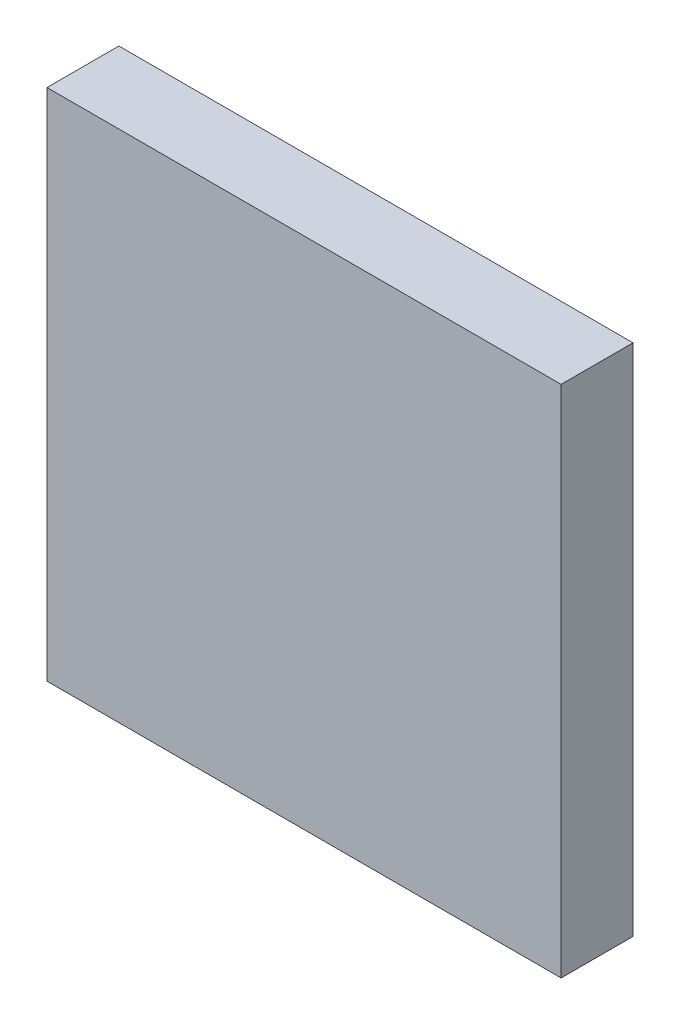
ISO-10303-21;
HEADER;
FILE_DESCRIPTION(('STEP AP214'),'2;1');
FILE_NAME('part.step','',(''),(''),'','','');
FILE_SCHEMA(('AUTOMOTIVE_DESIGN { 1 0 10303 214 1 1 1 1 }'));
ENDSEC;
DATA;
#1=APPLICATION_CONTEXT('core data for automotive mechanical design processes');
#2=APPLICATION_PROTOCOL_DEFINITION('international standard','automotive_design',2000,#1);
#3=PRODUCT_CONTEXT('',#1,'mechanical');
#4=PRODUCT('Part','Part','',(#3));
#5=PRODUCT_RELATED_PRODUCT_CATEGORY('part','',(#4));
#6=PRODUCT_DEFINITION_FORMATION('','',#4);
#7=PRODUCT_DEFINITION_CONTEXT('part definition',#1,'design');
#8=PRODUCT_DEFINITION('design','',#6,#7);
#9=PRODUCT_DEFINITION_SHAPE('','',#8);
#10=(LENGTH_UNIT() NAMED_UNIT(*) SI_UNIT(.MILLI.,.METRE.));
#11=(NAMED_UNIT(*) PLANE_ANGLE_UNIT() SI_UNIT($,.RADIAN.));
#12=(NAMED_UNIT(*) SI_UNIT($,.STERADIAN.) SOLID_ANGLE_UNIT());
#13=UNCERTAINTY_MEASURE_WITH_UNIT(LENGTH_MEASURE(1.E-05),#10,'distance_accuracy_value','');
#14=(GEOMETRIC_REPRESENTATION_CONTEXT(3) GLOBAL_UNCERTAINTY_ASSIGNED_CONTEXT((#13)) GLOBAL_UNIT_ASSIGNED_CONTEXT((#10,
#11,#12)) REPRESENTATION_CONTEXT('',''));
#15=CARTESIAN_POINT('',(0.,0.,0.));
#16=DIRECTION('',(0.,0.,1.));
#17=DIRECTION('',(1.,0.,0.));
#18=AXIS2_PLACEMENT_3D('',#15,#16,#17);
#19=CARTESIAN_POINT('',(1.270000005443E-06,1.270000005319E-06,1.00000054));
#20=DIRECTION('',(0.,0.,1.));
#21=DIRECTION('',(1.,0.,0.));
#22=AXIS2_PLACEMENT_3D('',#19,#20,#21);
#23=PLANE('',#22);
#24=DIRECTION('',(0.,1.,0.));
#25=VECTOR('',#24,1.);
#26=CARTESIAN_POINT('',(-3.5749992,3.57500174,1.00000054));
#27=LINE('',#26,#25);
#28=CARTESIAN_POINT('',(-3.5749992,3.57500174,1.00000054));
#29=VERTEX_POINT('',#28);
#30=CARTESIAN_POINT('',(-3.5749992,-3.5749992,1.00000054));
#31=VERTEX_POINT('',#30);
#32=EDGE_CURVE('E76',#29,#31,#27,.F.);
#33=ORIENTED_EDGE('',*,*,#32,.T.);
#34=DIRECTION('',(1.,0.,0.));
#35=VECTOR('',#34,1.);
#36=CARTESIAN_POINT('',(-3.5749992,-3.5749992,1.00000054));
#37=LINE('',#36,#35);
#38=CARTESIAN_POINT('',(3.57500174,-3.5749992,1.00000054));
#39=VERTEX_POINT('',#38);
#40=EDGE_CURVE('E58',#31,#39,#37,.T.);
#41=ORIENTED_EDGE('',*,*,#40,.T.);
#42=DIRECTION('',(0.,1.,0.));
#43=VECTOR('',#42,1.);
#44=CARTESIAN_POINT('',(3.57500174,-3.5749992,1.00000054));
#45=LINE('',#44,#43);
#46=CARTESIAN_POINT('',(3.57500174,3.57500174,1.00000054));
#47=VERTEX_POINT('',#46);
#48=EDGE_CURVE('E20',#39,#47,#45,.T.);
#49=ORIENTED_EDGE('',*,*,#48,.T.);
#50=DIRECTION('',(1.,0.,0.));
#51=VECTOR('',#50,1.);
#52=CARTESIAN_POINT('',(3.57500174,3.57500174,1.00000054));
#53=LINE('',#52,#51);
#54=EDGE_CURVE('E55',#47,#29,#53,.F.);
#55=ORIENTED_EDGE('',*,*,#54,.T.);
#56=EDGE_LOOP('',(#33,#41,#49,#55));
#57=FACE_BOUND('',#56,.T.);
#58=ADVANCED_FACE('F17',(#57),#23,.T.);
#59=CARTESIAN_POINT('',(3.57500174,-3.5749992,0.));
#60=DIRECTION('',(-1.,0.,0.));
#61=DIRECTION('',(0.,0.,1.));
#62=AXIS2_PLACEMENT_3D('',#59,#60,#61);
#63=PLANE('',#62);
#64=DIRECTION('',(0.,0.,-1.));
#65=VECTOR('',#64,1.);
#66=CARTESIAN_POINT('',(3.57500174,3.57500174,0.));
#67=LINE('',#66,#65);
#68=CARTESIAN_POINT('',(3.57500174,3.57500174,0.));
#69=VERTEX_POINT('',#68);
#70=EDGE_CURVE('E63',#69,#47,#67,.F.);
#71=ORIENTED_EDGE('',*,*,#70,.T.);
#72=ORIENTED_EDGE('',*,*,#48,.F.);
#73=DIRECTION('',(0.,0.,1.));
#74=VECTOR('',#73,1.);
#75=CARTESIAN_POINT('',(3.57500174,-3.5749992,0.));
#76=LINE('',#75,#74);
#77=CARTESIAN_POINT('',(3.57500174,-3.5749992,0.));
#78=VERTEX_POINT('',#77);
#79=EDGE_CURVE('E80',#39,#78,#76,.F.);
#80=ORIENTED_EDGE('',*,*,#79,.T.);
#81=DIRECTION('',(0.,1.,0.));
#82=VECTOR('',#81,1.);
#83=CARTESIAN_POINT('',(3.57500174,1.270000005319E-06,0.));
#84=LINE('',#83,#82);
#85=EDGE_CURVE('E73',#78,#69,#84,.T.);
#86=ORIENTED_EDGE('',*,*,#85,.T.);
#87=EDGE_LOOP('',(#71,#72,#80,#86));
#88=FACE_BOUND('',#87,.T.);
#89=ADVANCED_FACE('F72',(#88),#63,.F.);
#90=CARTESIAN_POINT('',(3.57500174,3.57500174,0.));
#91=DIRECTION('',(0.,-1.,0.));
#92=DIRECTION('',(0.,0.,-1.));
#93=AXIS2_PLACEMENT_3D('',#90,#91,#92);
#94=PLANE('',#93);
#95=DIRECTION('',(0.,0.,-1.));
#96=VECTOR('',#95,1.);
#97=CARTESIAN_POINT('',(-3.5749992,3.57500174,0.));
#98=LINE('',#97,#96);
#99=CARTESIAN_POINT('',(-3.5749992,3.57500174,0.));
#100=VERTEX_POINT('',#99);
#101=EDGE_CURVE('E69',#100,#29,#98,.F.);
#102=ORIENTED_EDGE('',*,*,#101,.T.);
#103=ORIENTED_EDGE('',*,*,#54,.F.);
#104=ORIENTED_EDGE('',*,*,#70,.F.);
#105=DIRECTION('',(1.,0.,0.));
#106=VECTOR('',#105,1.);
#107=CARTESIAN_POINT('',(1.270000005443E-06,3.57500174,0.));
#108=LINE('',#107,#106);
#109=EDGE_CURVE('E83',#69,#100,#108,.F.);
#110=ORIENTED_EDGE('',*,*,#109,.T.);
#111=EDGE_LOOP('',(#102,#103,#104,#110));
#112=FACE_BOUND('',#111,.T.);
#113=ADVANCED_FACE('F66',(#112),#94,.F.);
#114=CARTESIAN_POINT('',(-3.5749992,3.57500174,0.));
#115=DIRECTION('',(1.,0.,0.));
#116=DIRECTION('',(0.,0.,-1.));
#117=AXIS2_PLACEMENT_3D('',#114,#115,#116);
#118=PLANE('',#117);
#119=DIRECTION('',(0.,0.,1.));
#120=VECTOR('',#119,1.);
#121=CARTESIAN_POINT('',(-3.5749992,-3.5749992,0.));
#122=LINE('',#121,#120);
#123=CARTESIAN_POINT('',(-3.5749992,-3.5749992,0.));
#124=VERTEX_POINT('',#123);
#125=EDGE_CURVE('E34',#124,#31,#122,.T.);
#126=ORIENTED_EDGE('',*,*,#125,.T.);
#127=ORIENTED_EDGE('',*,*,#32,.F.);
#128=ORIENTED_EDGE('',*,*,#101,.F.);
#129=DIRECTION('',(0.,1.,0.));
#130=VECTOR('',#129,1.);
#131=CARTESIAN_POINT('',(-3.5749992,1.270000005319E-06,0.));
#132=LINE('',#131,#130);
#133=EDGE_CURVE('E26',#100,#124,#132,.F.);
#134=ORIENTED_EDGE('',*,*,#133,.T.);
#135=EDGE_LOOP('',(#126,#127,#128,#134));
#136=FACE_BOUND('',#135,.T.);
#137=ADVANCED_FACE('F88',(#136),#118,.F.);
#138=CARTESIAN_POINT('',(-3.5749992,-3.5749992,0.));
#139=DIRECTION('',(0.,1.,0.));
#140=DIRECTION('',(0.,0.,1.));
#141=AXIS2_PLACEMENT_3D('',#138,#139,#140);
#142=PLANE('',#141);
#143=ORIENTED_EDGE('',*,*,#79,.F.);
#144=ORIENTED_EDGE('',*,*,#40,.F.);
#145=ORIENTED_EDGE('',*,*,#125,.F.);
#146=DIRECTION('',(1.,0.,0.));
#147=VECTOR('',#146,1.);
#148=CARTESIAN_POINT('',(1.270000005443E-06,-3.5749992,0.));
#149=LINE('',#148,#147);
#150=EDGE_CURVE('E11',#124,#78,#149,.T.);
#151=ORIENTED_EDGE('',*,*,#150,.T.);
#152=EDGE_LOOP('',(#143,#144,#145,#151));
#153=FACE_BOUND('',#152,.T.);
#154=ADVANCED_FACE('F91',(#153),#142,.F.);
#155=CARTESIAN_POINT('',(1.270000005443E-06,1.270000005319E-06,0.));
#156=DIRECTION('',(0.,0.,1.));
#157=DIRECTION('',(1.,0.,0.));
#158=AXIS2_PLACEMENT_3D('',#155,#156,#157);
#159=PLANE('',#158);
#160=ORIENTED_EDGE('',*,*,#133,.F.);
#161=ORIENTED_EDGE('',*,*,#109,.F.);
#162=ORIENTED_EDGE('',*,*,#85,.F.);
#163=ORIENTED_EDGE('',*,*,#150,.F.);
#164=EDGE_LOOP('',(#160,#161,#162,#163));
#165=FACE_BOUND('',#164,.T.);
#166=ADVANCED_FACE('F90',(#165),#159,.F.);
#167=CLOSED_SHELL('',(#58,#89,#113,#137,#154,#166));
#168=MANIFOLD_SOLID_BREP('B1',#167);
#169=ADVANCED_BREP_SHAPE_REPRESENTATION('',(#18,#168),#14);
#170=SHAPE_DEFINITION_REPRESENTATION(#9,#169);
ENDSEC;
END-ISO-10303-21;
